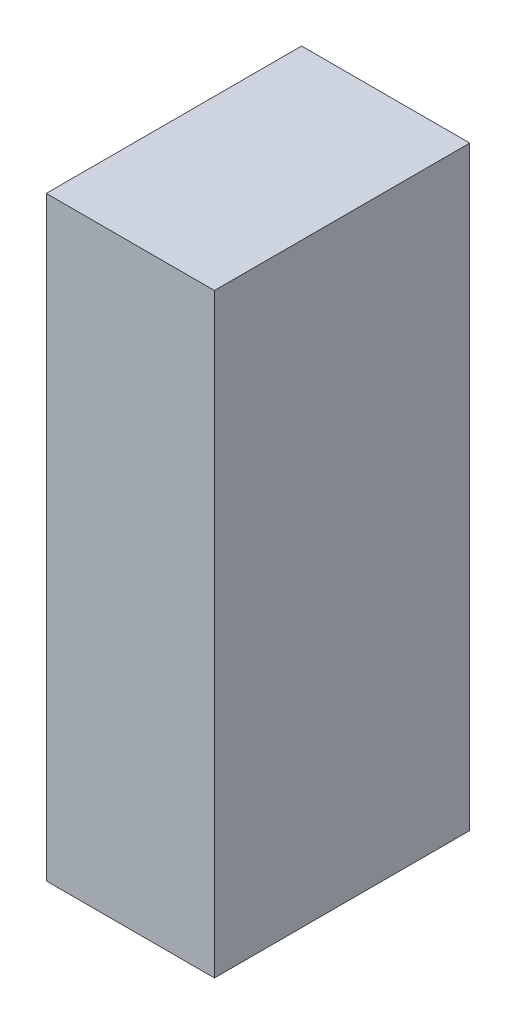
ISO-10303-21;
HEADER;
FILE_DESCRIPTION(('STEP AP214'),'2;1');
FILE_NAME('part.step','',(''),(''),'','','');
FILE_SCHEMA(('AUTOMOTIVE_DESIGN { 1 0 10303 214 1 1 1 1 }'));
ENDSEC;
DATA;
#1=APPLICATION_CONTEXT('core data for automotive mechanical design processes');
#2=APPLICATION_PROTOCOL_DEFINITION('international standard','automotive_design',2000,#1);
#3=PRODUCT_CONTEXT('',#1,'mechanical');
#4=PRODUCT('Part','Part','',(#3));
#5=PRODUCT_RELATED_PRODUCT_CATEGORY('part','',(#4));
#6=PRODUCT_DEFINITION_FORMATION('','',#4);
#7=PRODUCT_DEFINITION_CONTEXT('part definition',#1,'design');
#8=PRODUCT_DEFINITION('design','',#6,#7);
#9=PRODUCT_DEFINITION_SHAPE('','',#8);
#10=(LENGTH_UNIT() NAMED_UNIT(*) SI_UNIT(.MILLI.,.METRE.));
#11=(NAMED_UNIT(*) PLANE_ANGLE_UNIT() SI_UNIT($,.RADIAN.));
#12=(NAMED_UNIT(*) SI_UNIT($,.STERADIAN.) SOLID_ANGLE_UNIT());
#13=UNCERTAINTY_MEASURE_WITH_UNIT(LENGTH_MEASURE(1.E-05),#10,'distance_accuracy_value','');
#14=(GEOMETRIC_REPRESENTATION_CONTEXT(3) GLOBAL_UNCERTAINTY_ASSIGNED_CONTEXT((#13)) GLOBAL_UNIT_ASSIGNED_CONTEXT((#10,
#11,#12)) REPRESENTATION_CONTEXT('',''));
#15=CARTESIAN_POINT('',(0.,0.,0.));
#16=DIRECTION('',(0.,0.,1.));
#17=DIRECTION('',(1.,0.,0.));
#18=AXIS2_PLACEMENT_3D('',#15,#16,#17);
#19=CARTESIAN_POINT('',(-0.24699214,-0.87449152,0.));
#20=DIRECTION('',(-0.999999999998946,1.45227462341292E-06,0.));
#21=DIRECTION('',(1.45227462341292E-06,0.999999999998946,0.));
#22=AXIS2_PLACEMENT_3D('',#19,#20,#21);
#23=PLANE('',#22);
#24=DIRECTION('',(0.,0.,1.));
#25=VECTOR('',#24,1.);
#26=CARTESIAN_POINT('',(-0.24699214,-0.87449152,0.));
#27=LINE('',#26,#25);
#28=CARTESIAN_POINT('',(-0.24699214,-0.87449152,0.));
#29=VERTEX_POINT('',#28);
#30=CARTESIAN_POINT('',(-0.24699214,-0.87449152,0.75000104));
#31=VERTEX_POINT('',#30);
#32=EDGE_CURVE('E11',#29,#31,#27,.T.);
#33=ORIENTED_EDGE('',*,*,#32,.T.);
#34=DIRECTION('',(1.45227462341292E-06,0.999999999998946,0.));
#35=VECTOR('',#34,1.);
#36=CARTESIAN_POINT('',(-0.24699214,-0.87449152,0.75000104));
#37=LINE('',#36,#35);
#38=CARTESIAN_POINT('',(-0.2469896,0.87448898,0.75000104));
#39=VERTEX_POINT('',#38);
#40=EDGE_CURVE('E24',#31,#39,#37,.T.);
#41=ORIENTED_EDGE('',*,*,#40,.T.);
#42=DIRECTION('',(0.,0.,1.));
#43=VECTOR('',#42,1.);
#44=CARTESIAN_POINT('',(-0.2469896,0.87448898,0.));
#45=LINE('',#44,#43);
#46=CARTESIAN_POINT('',(-0.2469896,0.87448898,0.));
#47=VERTEX_POINT('',#46);
#48=EDGE_CURVE('E85',#47,#39,#45,.T.);
#49=ORIENTED_EDGE('',*,*,#48,.F.);
#50=DIRECTION('',(1.45227462341292E-06,0.999999999998946,0.));
#51=VECTOR('',#50,1.);
#52=CARTESIAN_POINT('',(-0.24699214,-0.87449152,0.));
#53=LINE('',#52,#51);
#54=EDGE_CURVE('E83',#29,#47,#53,.T.);
#55=ORIENTED_EDGE('',*,*,#54,.F.);
#56=EDGE_LOOP('',(#33,#41,#49,#55));
#57=FACE_BOUND('',#56,.T.);
#58=ADVANCED_FACE('F17',(#57),#23,.T.);
#59=CARTESIAN_POINT('',(-0.2469896,0.87448898,0.));
#60=DIRECTION('',(-5.14189046130287E-06,0.999999999986781,0.));
#61=DIRECTION('',(0.999999999986781,5.14189046130287E-06,0.));
#62=AXIS2_PLACEMENT_3D('',#59,#60,#61);
#63=PLANE('',#62);
#64=ORIENTED_EDGE('',*,*,#48,.T.);
#65=DIRECTION('',(0.999999999986781,5.14189046130287E-06,0.));
#66=VECTOR('',#65,1.);
#67=CARTESIAN_POINT('',(-0.2469896,0.87448898,0.75000104));
#68=LINE('',#67,#66);
#69=CARTESIAN_POINT('',(0.24699214,0.87449152,0.75000104));
#70=VERTEX_POINT('',#69);
#71=EDGE_CURVE('E81',#39,#70,#68,.T.);
#72=ORIENTED_EDGE('',*,*,#71,.T.);
#73=DIRECTION('',(0.,0.,1.));
#74=VECTOR('',#73,1.);
#75=CARTESIAN_POINT('',(0.24699214,0.87449152,0.));
#76=LINE('',#75,#74);
#77=CARTESIAN_POINT('',(0.24699214,0.87449152,0.));
#78=VERTEX_POINT('',#77);
#79=EDGE_CURVE('E79',#78,#70,#76,.T.);
#80=ORIENTED_EDGE('',*,*,#79,.F.);
#81=DIRECTION('',(0.999999999986781,5.14189046130287E-06,0.));
#82=VECTOR('',#81,1.);
#83=CARTESIAN_POINT('',(-0.2469896,0.87448898,0.));
#84=LINE('',#83,#82);
#85=EDGE_CURVE('E70',#47,#78,#84,.T.);
#86=ORIENTED_EDGE('',*,*,#85,.F.);
#87=EDGE_LOOP('',(#64,#72,#80,#86));
#88=FACE_BOUND('',#87,.T.);
#89=ADVANCED_FACE('F90',(#88),#63,.T.);
#90=CARTESIAN_POINT('',(0.24699214,0.87449152,0.));
#91=DIRECTION('',(1.,0.,0.));
#92=DIRECTION('',(0.,-1.,0.));
#93=AXIS2_PLACEMENT_3D('',#90,#91,#92);
#94=PLANE('',#93);
#95=ORIENTED_EDGE('',*,*,#79,.T.);
#96=DIRECTION('',(0.,-1.,0.));
#97=VECTOR('',#96,1.);
#98=CARTESIAN_POINT('',(0.24699214,0.87449152,0.75000104));
#99=LINE('',#98,#97);
#100=CARTESIAN_POINT('',(0.24699214,-0.87449152,0.75000104));
#101=VERTEX_POINT('',#100);
#102=EDGE_CURVE('E60',#70,#101,#99,.T.);
#103=ORIENTED_EDGE('',*,*,#102,.T.);
#104=DIRECTION('',(0.,0.,1.));
#105=VECTOR('',#104,1.);
#106=CARTESIAN_POINT('',(0.24699214,-0.87449152,0.));
#107=LINE('',#106,#105);
#108=CARTESIAN_POINT('',(0.24699214,-0.87449152,0.));
#109=VERTEX_POINT('',#108);
#110=EDGE_CURVE('E54',#109,#101,#107,.T.);
#111=ORIENTED_EDGE('',*,*,#110,.F.);
#112=DIRECTION('',(0.,-1.,0.));
#113=VECTOR('',#112,1.);
#114=CARTESIAN_POINT('',(0.24699214,0.87449152,0.));
#115=LINE('',#114,#113);
#116=EDGE_CURVE('E58',#78,#109,#115,.T.);
#117=ORIENTED_EDGE('',*,*,#116,.F.);
#118=EDGE_LOOP('',(#95,#103,#111,#117));
#119=FACE_BOUND('',#118,.T.);
#120=ADVANCED_FACE('F57',(#119),#94,.T.);
#121=CARTESIAN_POINT('',(0.24699214,-0.87449152,0.));
#122=DIRECTION('',(0.,-1.,0.));
#123=DIRECTION('',(-1.,0.,0.));
#124=AXIS2_PLACEMENT_3D('',#121,#122,#123);
#125=PLANE('',#124);
#126=ORIENTED_EDGE('',*,*,#110,.T.);
#127=DIRECTION('',(-1.,0.,0.));
#128=VECTOR('',#127,1.);
#129=CARTESIAN_POINT('',(0.24699214,-0.87449152,0.75000104));
#130=LINE('',#129,#128);
#131=EDGE_CURVE('E71',#101,#31,#130,.T.);
#132=ORIENTED_EDGE('',*,*,#131,.T.);
#133=ORIENTED_EDGE('',*,*,#32,.F.);
#134=DIRECTION('',(-1.,0.,0.));
#135=VECTOR('',#134,1.);
#136=CARTESIAN_POINT('',(0.24699214,-0.87449152,0.));
#137=LINE('',#136,#135);
#138=EDGE_CURVE('E68',#109,#29,#137,.T.);
#139=ORIENTED_EDGE('',*,*,#138,.F.);
#140=EDGE_LOOP('',(#126,#132,#133,#139));
#141=FACE_BOUND('',#140,.T.);
#142=ADVANCED_FACE('F73',(#141),#125,.T.);
#143=CARTESIAN_POINT('',(-0.24699214,-0.87449152,0.));
#144=DIRECTION('',(0.,0.,1.));
#145=DIRECTION('',(1.,0.,0.));
#146=AXIS2_PLACEMENT_3D('',#143,#144,#145);
#147=PLANE('',#146);
#148=ORIENTED_EDGE('',*,*,#54,.T.);
#149=ORIENTED_EDGE('',*,*,#85,.T.);
#150=ORIENTED_EDGE('',*,*,#116,.T.);
#151=ORIENTED_EDGE('',*,*,#138,.T.);
#152=EDGE_LOOP('',(#148,#149,#150,#151));
#153=FACE_BOUND('',#152,.T.);
#154=ADVANCED_FACE('F67',(#153),#147,.F.);
#155=CARTESIAN_POINT('',(-0.24699214,-0.87449152,0.75000104));
#156=DIRECTION('',(0.,0.,1.));
#157=DIRECTION('',(1.,0.,0.));
#158=AXIS2_PLACEMENT_3D('',#155,#156,#157);
#159=PLANE('',#158);
#160=ORIENTED_EDGE('',*,*,#131,.F.);
#161=ORIENTED_EDGE('',*,*,#102,.F.);
#162=ORIENTED_EDGE('',*,*,#71,.F.);
#163=ORIENTED_EDGE('',*,*,#40,.F.);
#164=EDGE_LOOP('',(#160,#161,#162,#163));
#165=FACE_BOUND('',#164,.T.);
#166=ADVANCED_FACE('F91',(#165),#159,.T.);
#167=CLOSED_SHELL('',(#58,#89,#120,#142,#154,#166));
#168=MANIFOLD_SOLID_BREP('B1',#167);
#169=ADVANCED_BREP_SHAPE_REPRESENTATION('',(#18,#168),#14);
#170=SHAPE_DEFINITION_REPRESENTATION(#9,#169);
ENDSEC;
END-ISO-10303-21;
